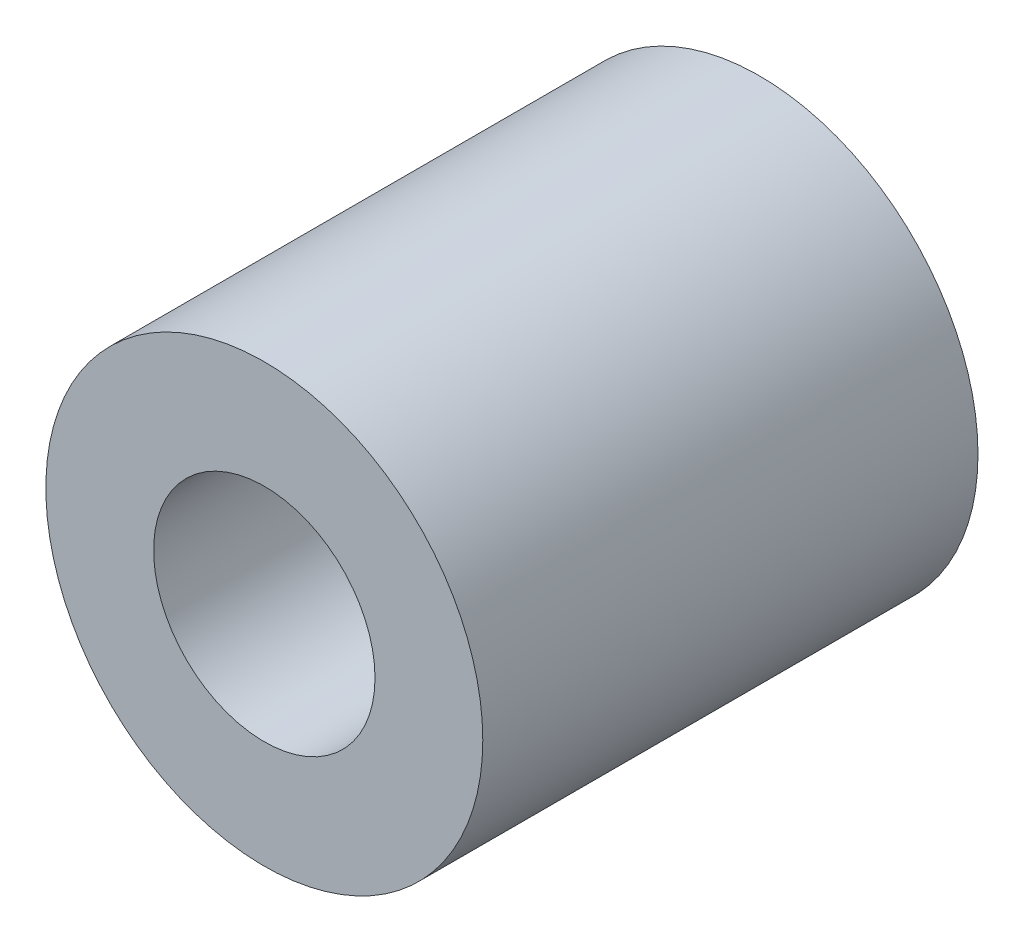
ISO-10303-21;
HEADER;
FILE_DESCRIPTION(('STEP AP214'),'2;1');
FILE_NAME('part.step','',(''),(''),'','','');
FILE_SCHEMA(('AUTOMOTIVE_DESIGN { 1 0 10303 214 1 1 1 1 }'));
ENDSEC;
DATA;
#1=APPLICATION_CONTEXT('core data for automotive mechanical design processes');
#2=APPLICATION_PROTOCOL_DEFINITION('international standard','automotive_design',2000,#1);
#3=PRODUCT_CONTEXT('',#1,'mechanical');
#4=PRODUCT('Part','Part','',(#3));
#5=PRODUCT_RELATED_PRODUCT_CATEGORY('part','',(#4));
#6=PRODUCT_DEFINITION_FORMATION('','',#4);
#7=PRODUCT_DEFINITION_CONTEXT('part definition',#1,'design');
#8=PRODUCT_DEFINITION('design','',#6,#7);
#9=PRODUCT_DEFINITION_SHAPE('','',#8);
#10=(LENGTH_UNIT() NAMED_UNIT(*) SI_UNIT(.MILLI.,.METRE.));
#11=(NAMED_UNIT(*) PLANE_ANGLE_UNIT() SI_UNIT($,.RADIAN.));
#12=(NAMED_UNIT(*) SI_UNIT($,.STERADIAN.) SOLID_ANGLE_UNIT());
#13=UNCERTAINTY_MEASURE_WITH_UNIT(LENGTH_MEASURE(1.E-05),#10,'distance_accuracy_value','');
#14=(GEOMETRIC_REPRESENTATION_CONTEXT(3) GLOBAL_UNCERTAINTY_ASSIGNED_CONTEXT((#13)) GLOBAL_UNIT_ASSIGNED_CONTEXT((#10,
#11,#12)) REPRESENTATION_CONTEXT('',''));
#15=CARTESIAN_POINT('',(0.,0.,0.));
#16=DIRECTION('',(0.,0.,1.));
#17=DIRECTION('',(1.,0.,0.));
#18=AXIS2_PLACEMENT_3D('',#15,#16,#17);
#19=CARTESIAN_POINT('',(0.,0.,21.59));
#20=DIRECTION('',(0.,0.,1.));
#21=DIRECTION('',(1.,0.,0.));
#22=AXIS2_PLACEMENT_3D('',#19,#20,#21);
#23=PLANE('',#22);
#24=CARTESIAN_POINT('',(0.,0.,21.59));
#25=DIRECTION('',(0.,0.,1.));
#26=DIRECTION('',(1.,0.,0.));
#27=AXIS2_PLACEMENT_3D('',#24,#25,#26);
#28=CIRCLE('',#27,9.525);
#29=CARTESIAN_POINT('',(9.525,0.,21.59));
#30=VERTEX_POINT('',#29);
#31=EDGE_CURVE('E10',#30,#30,#28,.T.);
#32=ORIENTED_EDGE('',*,*,#31,.T.);
#33=EDGE_LOOP('',(#32));
#34=FACE_BOUND('',#33,.T.);
#35=CARTESIAN_POINT('',(0.,0.,21.59));
#36=DIRECTION('',(0.,0.,1.));
#37=DIRECTION('',(1.,0.,0.));
#38=AXIS2_PLACEMENT_3D('',#35,#36,#37);
#39=CIRCLE('',#38,4.826);
#40=CARTESIAN_POINT('',(4.826,0.,21.59));
#41=VERTEX_POINT('',#40);
#42=EDGE_CURVE('E43',#41,#41,#39,.T.);
#43=ORIENTED_EDGE('',*,*,#42,.F.);
#44=EDGE_LOOP('',(#43));
#45=FACE_BOUND('',#44,.T.);
#46=ADVANCED_FACE('F32',(#34,#45),#23,.T.);
#47=CARTESIAN_POINT('',(0.,0.,0.));
#48=DIRECTION('',(0.,0.,1.));
#49=DIRECTION('',(1.,0.,0.));
#50=AXIS2_PLACEMENT_3D('',#47,#48,#49);
#51=PLANE('',#50);
#52=CARTESIAN_POINT('',(0.,0.,0.));
#53=DIRECTION('',(0.,0.,1.));
#54=DIRECTION('',(1.,0.,0.));
#55=AXIS2_PLACEMENT_3D('',#52,#53,#54);
#56=CIRCLE('',#55,9.525);
#57=CARTESIAN_POINT('',(9.525,0.,0.));
#58=VERTEX_POINT('',#57);
#59=EDGE_CURVE('E36',#58,#58,#56,.T.);
#60=ORIENTED_EDGE('',*,*,#59,.F.);
#61=EDGE_LOOP('',(#60));
#62=FACE_BOUND('',#61,.T.);
#63=CARTESIAN_POINT('',(0.,0.,0.));
#64=DIRECTION('',(0.,0.,1.));
#65=DIRECTION('',(1.,0.,0.));
#66=AXIS2_PLACEMENT_3D('',#63,#64,#65);
#67=CIRCLE('',#66,4.826);
#68=CARTESIAN_POINT('',(4.826,0.,0.));
#69=VERTEX_POINT('',#68);
#70=EDGE_CURVE('E45',#69,#69,#67,.T.);
#71=ORIENTED_EDGE('',*,*,#70,.T.);
#72=EDGE_LOOP('',(#71));
#73=FACE_BOUND('',#72,.T.);
#74=ADVANCED_FACE('F55',(#62,#73),#51,.F.);
#75=CARTESIAN_POINT('',(0.,0.,21.59));
#76=DIRECTION('',(0.,0.,-1.));
#77=DIRECTION('',(-1.,0.,0.));
#78=AXIS2_PLACEMENT_3D('',#75,#76,#77);
#79=CYLINDRICAL_SURFACE('',#78,9.525);
#80=ORIENTED_EDGE('',*,*,#31,.F.);
#81=EDGE_LOOP('',(#80));
#82=FACE_BOUND('',#81,.T.);
#83=ORIENTED_EDGE('',*,*,#59,.T.);
#84=EDGE_LOOP('',(#83));
#85=FACE_BOUND('',#84,.T.);
#86=ADVANCED_FACE('F34',(#82,#85),#79,.T.);
#87=CARTESIAN_POINT('',(0.,0.,21.59));
#88=DIRECTION('',(0.,0.,-1.));
#89=DIRECTION('',(-1.,0.,0.));
#90=AXIS2_PLACEMENT_3D('',#87,#88,#89);
#91=CYLINDRICAL_SURFACE('',#90,4.826);
#92=ORIENTED_EDGE('',*,*,#42,.T.);
#93=EDGE_LOOP('',(#92));
#94=FACE_BOUND('',#93,.T.);
#95=ORIENTED_EDGE('',*,*,#70,.F.);
#96=EDGE_LOOP('',(#95));
#97=FACE_BOUND('',#96,.T.);
#98=ADVANCED_FACE('F51',(#94,#97),#91,.F.);
#99=CLOSED_SHELL('',(#46,#74,#86,#98));
#100=MANIFOLD_SOLID_BREP('B2',#99);
#101=ADVANCED_BREP_SHAPE_REPRESENTATION('',(#18,#100),#14);
#102=SHAPE_DEFINITION_REPRESENTATION(#9,#101);
ENDSEC;
END-ISO-10303-21;
